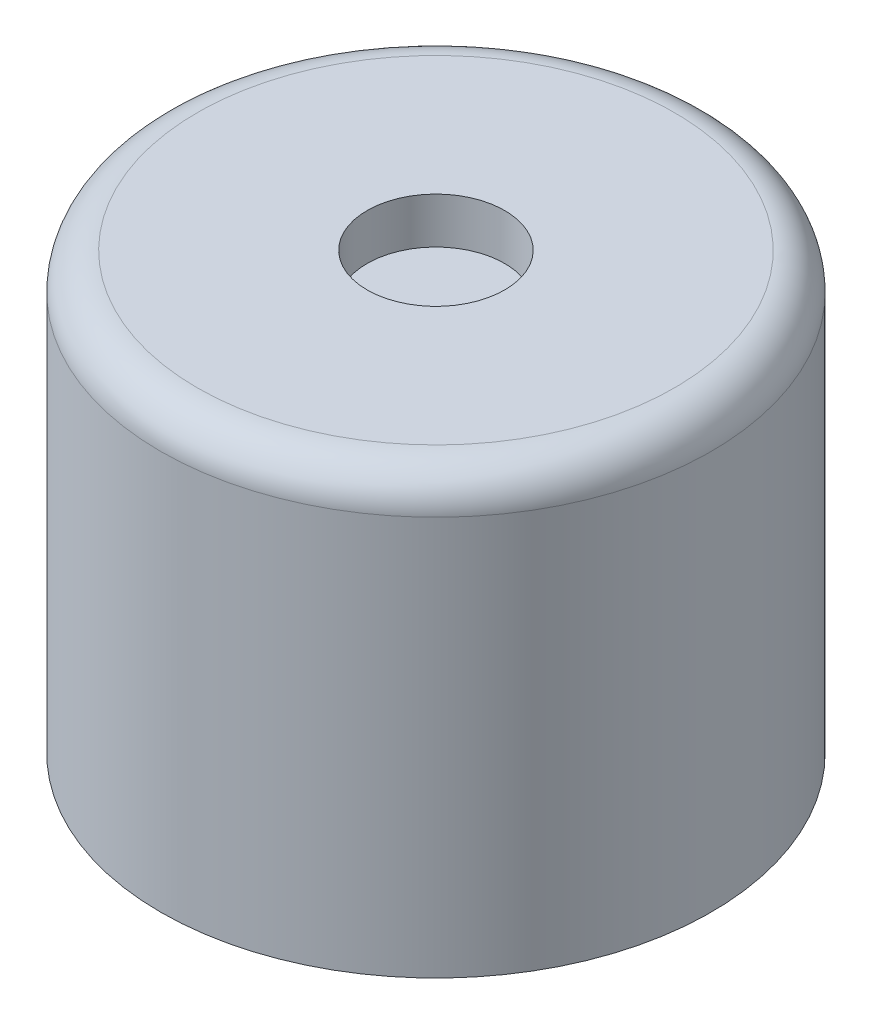
ISO-10303-21;
HEADER;
FILE_DESCRIPTION(('STEP AP214'),'2;1');
FILE_NAME('part.step','',(''),(''),'','','');
FILE_SCHEMA(('AUTOMOTIVE_DESIGN { 1 0 10303 214 1 1 1 1 }'));
ENDSEC;
DATA;
#1=APPLICATION_CONTEXT('core data for automotive mechanical design processes');
#2=APPLICATION_PROTOCOL_DEFINITION('international standard','automotive_design',2000,#1);
#3=PRODUCT_CONTEXT('',#1,'mechanical');
#4=PRODUCT('Part','Part','',(#3));
#5=PRODUCT_RELATED_PRODUCT_CATEGORY('part','',(#4));
#6=PRODUCT_DEFINITION_FORMATION('','',#4);
#7=PRODUCT_DEFINITION_CONTEXT('part definition',#1,'design');
#8=PRODUCT_DEFINITION('design','',#6,#7);
#9=PRODUCT_DEFINITION_SHAPE('','',#8);
#10=(LENGTH_UNIT() NAMED_UNIT(*) SI_UNIT(.MILLI.,.METRE.));
#11=(NAMED_UNIT(*) PLANE_ANGLE_UNIT() SI_UNIT($,.RADIAN.));
#12=(NAMED_UNIT(*) SI_UNIT($,.STERADIAN.) SOLID_ANGLE_UNIT());
#13=UNCERTAINTY_MEASURE_WITH_UNIT(LENGTH_MEASURE(1.E-05),#10,'distance_accuracy_value','');
#14=(GEOMETRIC_REPRESENTATION_CONTEXT(3) GLOBAL_UNCERTAINTY_ASSIGNED_CONTEXT((#13)) GLOBAL_UNIT_ASSIGNED_CONTEXT((#10,
#11,#12)) REPRESENTATION_CONTEXT('',''));
#15=CARTESIAN_POINT('',(0.,0.,0.));
#16=DIRECTION('',(0.,0.,1.));
#17=DIRECTION('',(1.,0.,0.));
#18=AXIS2_PLACEMENT_3D('',#15,#16,#17);
#19=CARTESIAN_POINT('',(0.,9.5,0.));
#20=DIRECTION('',(0.,-1.,0.));
#21=DIRECTION('',(0.,0.,-1.));
#22=AXIS2_PLACEMENT_3D('',#19,#20,#21);
#23=CYLINDRICAL_SURFACE('',#22,6.);
#24=CARTESIAN_POINT('',(0.,8.7,0.));
#25=DIRECTION('',(0.,1.,0.));
#26=DIRECTION('',(0.,0.,1.));
#27=AXIS2_PLACEMENT_3D('',#24,#25,#26);
#28=CIRCLE('',#27,6.);
#29=CARTESIAN_POINT('',(0.,8.7,6.));
#30=VERTEX_POINT('',#29);
#31=EDGE_CURVE('E10',#30,#30,#28,.F.);
#32=ORIENTED_EDGE('',*,*,#31,.T.);
#33=EDGE_LOOP('',(#32));
#34=FACE_BOUND('',#33,.T.);
#35=CARTESIAN_POINT('',(0.,0.,0.));
#36=DIRECTION('',(0.,1.,0.));
#37=DIRECTION('',(0.,0.,1.));
#38=AXIS2_PLACEMENT_3D('',#35,#36,#37);
#39=CIRCLE('',#38,6.);
#40=CARTESIAN_POINT('',(0.,0.,6.));
#41=VERTEX_POINT('',#40);
#42=EDGE_CURVE('E44',#41,#41,#39,.T.);
#43=ORIENTED_EDGE('',*,*,#42,.T.);
#44=EDGE_LOOP('',(#43));
#45=FACE_BOUND('',#44,.T.);
#46=ADVANCED_FACE('F33',(#34,#45),#23,.T.);
#47=CARTESIAN_POINT('',(0.,9.5,0.));
#48=DIRECTION('',(0.,1.,0.));
#49=DIRECTION('',(0.,0.,1.));
#50=AXIS2_PLACEMENT_3D('',#47,#48,#49);
#51=PLANE('',#50);
#52=CARTESIAN_POINT('',(0.,9.5,0.));
#53=DIRECTION('',(0.,1.,0.));
#54=DIRECTION('',(0.,0.,1.));
#55=AXIS2_PLACEMENT_3D('',#52,#53,#54);
#56=CIRCLE('',#55,5.2);
#57=CARTESIAN_POINT('',(0.,9.5,5.2));
#58=VERTEX_POINT('',#57);
#59=EDGE_CURVE('E40',#58,#58,#56,.T.);
#60=ORIENTED_EDGE('',*,*,#59,.T.);
#61=EDGE_LOOP('',(#60));
#62=FACE_BOUND('',#61,.T.);
#63=CARTESIAN_POINT('',(0.,9.5,0.));
#64=DIRECTION('',(0.,1.,0.));
#65=DIRECTION('',(0.,0.,1.));
#66=AXIS2_PLACEMENT_3D('',#63,#64,#65);
#67=CIRCLE('',#66,1.5);
#68=CARTESIAN_POINT('',(0.,9.5,1.5));
#69=VERTEX_POINT('',#68);
#70=EDGE_CURVE('E51',#69,#69,#67,.T.);
#71=ORIENTED_EDGE('',*,*,#70,.F.);
#72=EDGE_LOOP('',(#71));
#73=FACE_BOUND('',#72,.T.);
#74=ADVANCED_FACE('F66',(#62,#73),#51,.T.);
#75=CARTESIAN_POINT('',(0.,0.,0.));
#76=DIRECTION('',(0.,1.,0.));
#77=DIRECTION('',(0.,0.,1.));
#78=AXIS2_PLACEMENT_3D('',#75,#76,#77);
#79=PLANE('',#78);
#80=ORIENTED_EDGE('',*,*,#42,.F.);
#81=EDGE_LOOP('',(#80));
#82=FACE_BOUND('',#81,.T.);
#83=ADVANCED_FACE('F62',(#82),#79,.F.);
#84=CARTESIAN_POINT('',(0.,8.5,0.));
#85=DIRECTION('',(0.,1.,0.));
#86=DIRECTION('',(0.,0.,1.));
#87=AXIS2_PLACEMENT_3D('',#84,#85,#86);
#88=CYLINDRICAL_SURFACE('',#87,1.5);
#89=CARTESIAN_POINT('',(0.,8.5,0.));
#90=DIRECTION('',(0.,1.,0.));
#91=DIRECTION('',(0.,0.,1.));
#92=AXIS2_PLACEMENT_3D('',#89,#90,#91);
#93=CIRCLE('',#92,1.5);
#94=CARTESIAN_POINT('',(0.,8.5,1.5));
#95=VERTEX_POINT('',#94);
#96=EDGE_CURVE('E48',#95,#95,#93,.T.);
#97=ORIENTED_EDGE('',*,*,#96,.F.);
#98=EDGE_LOOP('',(#97));
#99=FACE_BOUND('',#98,.T.);
#100=ORIENTED_EDGE('',*,*,#70,.T.);
#101=EDGE_LOOP('',(#100));
#102=FACE_BOUND('',#101,.T.);
#103=ADVANCED_FACE('F59',(#99,#102),#88,.F.);
#104=CARTESIAN_POINT('',(0.,8.5,0.));
#105=DIRECTION('',(0.,1.,0.));
#106=DIRECTION('',(0.,0.,1.));
#107=AXIS2_PLACEMENT_3D('',#104,#105,#106);
#108=PLANE('',#107);
#109=ORIENTED_EDGE('',*,*,#96,.T.);
#110=EDGE_LOOP('',(#109));
#111=FACE_BOUND('',#110,.T.);
#112=ADVANCED_FACE('F57',(#111),#108,.T.);
#113=CARTESIAN_POINT('',(0.,8.7,0.));
#114=DIRECTION('',(0.,1.,0.));
#115=DIRECTION('',(0.,0.,1.));
#116=AXIS2_PLACEMENT_3D('',#113,#114,#115);
#117=TOROIDAL_SURFACE('',#116,5.2,0.8);
#118=ORIENTED_EDGE('',*,*,#31,.F.);
#119=EDGE_LOOP('',(#118));
#120=FACE_BOUND('',#119,.T.);
#121=ORIENTED_EDGE('',*,*,#59,.F.);
#122=EDGE_LOOP('',(#121));
#123=FACE_BOUND('',#122,.T.);
#124=ADVANCED_FACE('F35',(#120,#123),#117,.T.);
#125=CLOSED_SHELL('',(#46,#74,#83,#103,#112,#124));
#126=MANIFOLD_SOLID_BREP('B2',#125);
#127=ADVANCED_BREP_SHAPE_REPRESENTATION('',(#18,#126),#14);
#128=SHAPE_DEFINITION_REPRESENTATION(#9,#127);
ENDSEC;
END-ISO-10303-21;
